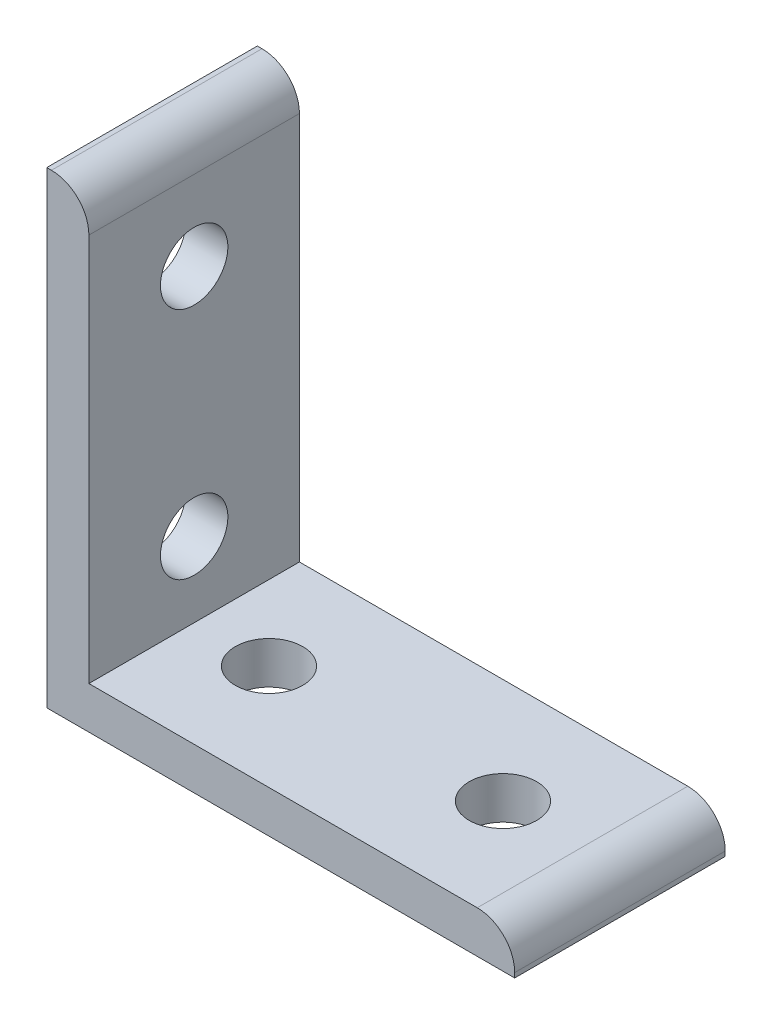
ISO-10303-21;
HEADER;
FILE_DESCRIPTION(('STEP AP214'),'2;1');
FILE_NAME('part.step','',(''),(''),'','','');
FILE_SCHEMA(('AUTOMOTIVE_DESIGN { 1 0 10303 214 1 1 1 1 }'));
ENDSEC;
DATA;
#1=APPLICATION_CONTEXT('core data for automotive mechanical design processes');
#2=APPLICATION_PROTOCOL_DEFINITION('international standard','automotive_design',2000,#1);
#3=PRODUCT_CONTEXT('',#1,'mechanical');
#4=PRODUCT('Part','Part','',(#3));
#5=PRODUCT_RELATED_PRODUCT_CATEGORY('part','',(#4));
#6=PRODUCT_DEFINITION_FORMATION('','',#4);
#7=PRODUCT_DEFINITION_CONTEXT('part definition',#1,'design');
#8=PRODUCT_DEFINITION('design','',#6,#7);
#9=PRODUCT_DEFINITION_SHAPE('','',#8);
#10=(LENGTH_UNIT() NAMED_UNIT(*) SI_UNIT(.MILLI.,.METRE.));
#11=(NAMED_UNIT(*) PLANE_ANGLE_UNIT() SI_UNIT($,.RADIAN.));
#12=(NAMED_UNIT(*) SI_UNIT($,.STERADIAN.) SOLID_ANGLE_UNIT());
#13=UNCERTAINTY_MEASURE_WITH_UNIT(LENGTH_MEASURE(1.E-05),#10,'distance_accuracy_value','');
#14=(GEOMETRIC_REPRESENTATION_CONTEXT(3) GLOBAL_UNCERTAINTY_ASSIGNED_CONTEXT((#13)) GLOBAL_UNIT_ASSIGNED_CONTEXT((#10,
#11,#12)) REPRESENTATION_CONTEXT('',''));
#15=CARTESIAN_POINT('',(0.,0.,0.));
#16=DIRECTION('',(0.,0.,1.));
#17=DIRECTION('',(1.,0.,0.));
#18=AXIS2_PLACEMENT_3D('',#15,#16,#17);
#19=CARTESIAN_POINT('',(0.,50.,22.5));
#20=DIRECTION('',(0.,-1.,0.));
#21=DIRECTION('',(0.,0.,-1.));
#22=AXIS2_PLACEMENT_3D('',#19,#20,#21);
#23=PLANE('',#22);
#24=DIRECTION('',(-1.,0.,0.));
#25=VECTOR('',#24,1.);
#26=CARTESIAN_POINT('',(0.,50.,22.5));
#27=LINE('',#26,#25);
#28=CARTESIAN_POINT('',(0.500000000000001,50.,22.5));
#29=VERTEX_POINT('',#28);
#30=CARTESIAN_POINT('',(0.,50.,22.5));
#31=VERTEX_POINT('',#30);
#32=EDGE_CURVE('E95',#29,#31,#27,.T.);
#33=ORIENTED_EDGE('',*,*,#32,.F.);
#34=DIRECTION('',(0.,0.,-1.));
#35=VECTOR('',#34,1.);
#36=CARTESIAN_POINT('',(0.500000000000001,50.,22.5));
#37=LINE('',#36,#35);
#38=CARTESIAN_POINT('',(0.500000000000001,50.,0.));
#39=VERTEX_POINT('',#38);
#40=EDGE_CURVE('E41',#29,#39,#37,.T.);
#41=ORIENTED_EDGE('',*,*,#40,.T.);
#42=DIRECTION('',(-1.,0.,0.));
#43=VECTOR('',#42,1.);
#44=CARTESIAN_POINT('',(0.,50.,0.));
#45=LINE('',#44,#43);
#46=CARTESIAN_POINT('',(0.,50.,0.));
#47=VERTEX_POINT('',#46);
#48=EDGE_CURVE('E117',#39,#47,#45,.T.);
#49=ORIENTED_EDGE('',*,*,#48,.T.);
#50=DIRECTION('',(0.,0.,-1.));
#51=VECTOR('',#50,1.);
#52=CARTESIAN_POINT('',(0.,50.,22.5));
#53=LINE('',#52,#51);
#54=EDGE_CURVE('E110',#31,#47,#53,.T.);
#55=ORIENTED_EDGE('',*,*,#54,.F.);
#56=EDGE_LOOP('',(#33,#41,#49,#55));
#57=FACE_BOUND('',#56,.T.);
#58=ADVANCED_FACE('F33',(#57),#23,.F.);
#59=CARTESIAN_POINT('',(0.,50.,22.5));
#60=DIRECTION('',(1.,0.,0.));
#61=DIRECTION('',(0.,0.,-1.));
#62=AXIS2_PLACEMENT_3D('',#59,#60,#61);
#63=PLANE('',#62);
#64=CARTESIAN_POINT('',(0.,37.5,11.25));
#65=DIRECTION('',(-1.,0.,0.));
#66=DIRECTION('',(0.,0.,1.));
#67=AXIS2_PLACEMENT_3D('',#64,#65,#66);
#68=CIRCLE('',#67,3.6);
#69=CARTESIAN_POINT('',(0.,37.5,14.85));
#70=VERTEX_POINT('',#69);
#71=EDGE_CURVE('E132',#70,#70,#68,.T.);
#72=ORIENTED_EDGE('',*,*,#71,.F.);
#73=EDGE_LOOP('',(#72));
#74=FACE_BOUND('',#73,.T.);
#75=CARTESIAN_POINT('',(0.,12.5,11.25));
#76=DIRECTION('',(-1.,0.,0.));
#77=DIRECTION('',(0.,0.,1.));
#78=AXIS2_PLACEMENT_3D('',#75,#76,#77);
#79=CIRCLE('',#78,3.6);
#80=CARTESIAN_POINT('',(0.,12.5,14.85));
#81=VERTEX_POINT('',#80);
#82=EDGE_CURVE('E141',#81,#81,#79,.T.);
#83=ORIENTED_EDGE('',*,*,#82,.F.);
#84=EDGE_LOOP('',(#83));
#85=FACE_BOUND('',#84,.T.);
#86=DIRECTION('',(0.,-1.,0.));
#87=VECTOR('',#86,1.);
#88=CARTESIAN_POINT('',(0.,50.,0.));
#89=LINE('',#88,#87);
#90=CARTESIAN_POINT('',(0.,0.,0.));
#91=VERTEX_POINT('',#90);
#92=EDGE_CURVE('E156',#47,#91,#89,.T.);
#93=ORIENTED_EDGE('',*,*,#92,.T.);
#94=DIRECTION('',(0.,0.,-1.));
#95=VECTOR('',#94,1.);
#96=CARTESIAN_POINT('',(0.,0.,22.5));
#97=LINE('',#96,#95);
#98=CARTESIAN_POINT('',(0.,0.,22.5));
#99=VERTEX_POINT('',#98);
#100=EDGE_CURVE('E112',#99,#91,#97,.T.);
#101=ORIENTED_EDGE('',*,*,#100,.F.);
#102=DIRECTION('',(0.,-1.,0.));
#103=VECTOR('',#102,1.);
#104=CARTESIAN_POINT('',(0.,50.,22.5));
#105=LINE('',#104,#103);
#106=EDGE_CURVE('E99',#31,#99,#105,.T.);
#107=ORIENTED_EDGE('',*,*,#106,.F.);
#108=ORIENTED_EDGE('',*,*,#54,.T.);
#109=EDGE_LOOP('',(#93,#101,#107,#108));
#110=FACE_BOUND('',#109,.T.);
#111=ADVANCED_FACE('F109',(#74,#85,#110),#63,.F.);
#112=CARTESIAN_POINT('',(0.,0.,22.5));
#113=DIRECTION('',(0.,1.,0.));
#114=DIRECTION('',(0.,0.,1.));
#115=AXIS2_PLACEMENT_3D('',#112,#113,#114);
#116=PLANE('',#115);
#117=CARTESIAN_POINT('',(37.5,0.,11.25));
#118=DIRECTION('',(0.,-1.,0.));
#119=DIRECTION('',(0.,0.,-1.));
#120=AXIS2_PLACEMENT_3D('',#117,#118,#119);
#121=CIRCLE('',#120,3.6);
#122=CARTESIAN_POINT('',(37.5,0.,7.65));
#123=VERTEX_POINT('',#122);
#124=EDGE_CURVE('E139',#123,#123,#121,.T.);
#125=ORIENTED_EDGE('',*,*,#124,.F.);
#126=EDGE_LOOP('',(#125));
#127=FACE_BOUND('',#126,.T.);
#128=CARTESIAN_POINT('',(12.5,0.,11.25));
#129=DIRECTION('',(0.,-1.,0.));
#130=DIRECTION('',(0.,0.,-1.));
#131=AXIS2_PLACEMENT_3D('',#128,#129,#130);
#132=CIRCLE('',#131,3.6);
#133=CARTESIAN_POINT('',(12.5,0.,7.65));
#134=VERTEX_POINT('',#133);
#135=EDGE_CURVE('E198',#134,#134,#132,.T.);
#136=ORIENTED_EDGE('',*,*,#135,.F.);
#137=EDGE_LOOP('',(#136));
#138=FACE_BOUND('',#137,.T.);
#139=DIRECTION('',(1.,0.,0.));
#140=VECTOR('',#139,1.);
#141=CARTESIAN_POINT('',(0.,0.,0.));
#142=LINE('',#141,#140);
#143=CARTESIAN_POINT('',(50.,0.,0.));
#144=VERTEX_POINT('',#143);
#145=EDGE_CURVE('E158',#91,#144,#142,.T.);
#146=ORIENTED_EDGE('',*,*,#145,.T.);
#147=DIRECTION('',(0.,0.,-1.));
#148=VECTOR('',#147,1.);
#149=CARTESIAN_POINT('',(50.,0.,22.5));
#150=LINE('',#149,#148);
#151=CARTESIAN_POINT('',(50.,0.,22.5));
#152=VERTEX_POINT('',#151);
#153=EDGE_CURVE('E124',#152,#144,#150,.T.);
#154=ORIENTED_EDGE('',*,*,#153,.F.);
#155=DIRECTION('',(1.,0.,0.));
#156=VECTOR('',#155,1.);
#157=CARTESIAN_POINT('',(0.,0.,22.5));
#158=LINE('',#157,#156);
#159=EDGE_CURVE('E114',#99,#152,#158,.T.);
#160=ORIENTED_EDGE('',*,*,#159,.F.);
#161=ORIENTED_EDGE('',*,*,#100,.T.);
#162=EDGE_LOOP('',(#146,#154,#160,#161));
#163=FACE_BOUND('',#162,.T.);
#164=ADVANCED_FACE('F207',(#127,#138,#163),#116,.F.);
#165=CARTESIAN_POINT('',(50.,4.5,22.5));
#166=DIRECTION('',(-1.,0.,0.));
#167=DIRECTION('',(0.,0.,1.));
#168=AXIS2_PLACEMENT_3D('',#165,#166,#167);
#169=PLANE('',#168);
#170=DIRECTION('',(0.,1.,0.));
#171=VECTOR('',#170,1.);
#172=CARTESIAN_POINT('',(50.,4.5,0.));
#173=LINE('',#172,#171);
#174=CARTESIAN_POINT('',(50.,0.500000000000001,0.));
#175=VERTEX_POINT('',#174);
#176=EDGE_CURVE('E165',#144,#175,#173,.T.);
#177=ORIENTED_EDGE('',*,*,#176,.T.);
#178=DIRECTION('',(0.,0.,-1.));
#179=VECTOR('',#178,1.);
#180=CARTESIAN_POINT('',(50.,0.500000000000001,22.5));
#181=LINE('',#180,#179);
#182=CARTESIAN_POINT('',(50.,0.500000000000001,22.5));
#183=VERTEX_POINT('',#182);
#184=EDGE_CURVE('E146',#175,#183,#181,.F.);
#185=ORIENTED_EDGE('',*,*,#184,.T.);
#186=DIRECTION('',(0.,1.,0.));
#187=VECTOR('',#186,1.);
#188=CARTESIAN_POINT('',(50.,4.5,22.5));
#189=LINE('',#188,#187);
#190=EDGE_CURVE('E180',#152,#183,#189,.T.);
#191=ORIENTED_EDGE('',*,*,#190,.F.);
#192=ORIENTED_EDGE('',*,*,#153,.T.);
#193=EDGE_LOOP('',(#177,#185,#191,#192));
#194=FACE_BOUND('',#193,.T.);
#195=ADVANCED_FACE('F178',(#194),#169,.F.);
#196=CARTESIAN_POINT('',(4.5,4.5,22.5));
#197=DIRECTION('',(0.,-1.,0.));
#198=DIRECTION('',(0.,0.,-1.));
#199=AXIS2_PLACEMENT_3D('',#196,#197,#198);
#200=PLANE('',#199);
#201=CARTESIAN_POINT('',(37.5,4.5,11.25));
#202=DIRECTION('',(0.,-1.,0.));
#203=DIRECTION('',(0.,0.,-1.));
#204=AXIS2_PLACEMENT_3D('',#201,#202,#203);
#205=CIRCLE('',#204,3.6);
#206=CARTESIAN_POINT('',(37.5,4.5,7.65));
#207=VERTEX_POINT('',#206);
#208=EDGE_CURVE('E138',#207,#207,#205,.T.);
#209=ORIENTED_EDGE('',*,*,#208,.T.);
#210=EDGE_LOOP('',(#209));
#211=FACE_BOUND('',#210,.T.);
#212=CARTESIAN_POINT('',(12.5,4.5,11.25));
#213=DIRECTION('',(0.,-1.,0.));
#214=DIRECTION('',(0.,0.,-1.));
#215=AXIS2_PLACEMENT_3D('',#212,#213,#214);
#216=CIRCLE('',#215,3.6);
#217=CARTESIAN_POINT('',(12.5,4.5,7.65));
#218=VERTEX_POINT('',#217);
#219=EDGE_CURVE('E135',#218,#218,#216,.T.);
#220=ORIENTED_EDGE('',*,*,#219,.T.);
#221=EDGE_LOOP('',(#220));
#222=FACE_BOUND('',#221,.T.);
#223=DIRECTION('',(-1.,0.,0.));
#224=VECTOR('',#223,1.);
#225=CARTESIAN_POINT('',(4.5,4.5,22.5));
#226=LINE('',#225,#224);
#227=CARTESIAN_POINT('',(46.,4.5,22.5));
#228=VERTEX_POINT('',#227);
#229=CARTESIAN_POINT('',(4.5,4.5,22.5));
#230=VERTEX_POINT('',#229);
#231=EDGE_CURVE('E190',#228,#230,#226,.T.);
#232=ORIENTED_EDGE('',*,*,#231,.F.);
#233=DIRECTION('',(0.,0.,-1.));
#234=VECTOR('',#233,1.);
#235=CARTESIAN_POINT('',(46.,4.5,22.5));
#236=LINE('',#235,#234);
#237=CARTESIAN_POINT('',(46.,4.5,0.));
#238=VERTEX_POINT('',#237);
#239=EDGE_CURVE('E119',#228,#238,#236,.T.);
#240=ORIENTED_EDGE('',*,*,#239,.T.);
#241=DIRECTION('',(-1.,0.,0.));
#242=VECTOR('',#241,1.);
#243=CARTESIAN_POINT('',(4.5,4.5,0.));
#244=LINE('',#243,#242);
#245=CARTESIAN_POINT('',(4.5,4.5,0.));
#246=VERTEX_POINT('',#245);
#247=EDGE_CURVE('E168',#238,#246,#244,.T.);
#248=ORIENTED_EDGE('',*,*,#247,.T.);
#249=DIRECTION('',(0.,0.,-1.));
#250=VECTOR('',#249,1.);
#251=CARTESIAN_POINT('',(4.5,4.5,22.5));
#252=LINE('',#251,#250);
#253=EDGE_CURVE('E171',#230,#246,#252,.T.);
#254=ORIENTED_EDGE('',*,*,#253,.F.);
#255=EDGE_LOOP('',(#232,#240,#248,#254));
#256=FACE_BOUND('',#255,.T.);
#257=ADVANCED_FACE('F188',(#211,#222,#256),#200,.F.);
#258=CARTESIAN_POINT('',(4.5,50.,22.5));
#259=DIRECTION('',(-1.,0.,0.));
#260=DIRECTION('',(0.,0.,1.));
#261=AXIS2_PLACEMENT_3D('',#258,#259,#260);
#262=PLANE('',#261);
#263=CARTESIAN_POINT('',(4.5,37.5,11.25));
#264=DIRECTION('',(-1.,0.,0.));
#265=DIRECTION('',(0.,0.,1.));
#266=AXIS2_PLACEMENT_3D('',#263,#264,#265);
#267=CIRCLE('',#266,3.6);
#268=CARTESIAN_POINT('',(4.5,37.5,14.85));
#269=VERTEX_POINT('',#268);
#270=EDGE_CURVE('E131',#269,#269,#267,.T.);
#271=ORIENTED_EDGE('',*,*,#270,.T.);
#272=EDGE_LOOP('',(#271));
#273=FACE_BOUND('',#272,.T.);
#274=CARTESIAN_POINT('',(4.5,12.5,11.25));
#275=DIRECTION('',(-1.,0.,0.));
#276=DIRECTION('',(0.,0.,1.));
#277=AXIS2_PLACEMENT_3D('',#274,#275,#276);
#278=CIRCLE('',#277,3.6);
#279=CARTESIAN_POINT('',(4.5,12.5,14.85));
#280=VERTEX_POINT('',#279);
#281=EDGE_CURVE('E128',#280,#280,#278,.T.);
#282=ORIENTED_EDGE('',*,*,#281,.T.);
#283=EDGE_LOOP('',(#282));
#284=FACE_BOUND('',#283,.T.);
#285=DIRECTION('',(0.,1.,0.));
#286=VECTOR('',#285,1.);
#287=CARTESIAN_POINT('',(4.5,50.,0.));
#288=LINE('',#287,#286);
#289=CARTESIAN_POINT('',(4.5,46.,0.));
#290=VERTEX_POINT('',#289);
#291=EDGE_CURVE('E105',#246,#290,#288,.T.);
#292=ORIENTED_EDGE('',*,*,#291,.T.);
#293=DIRECTION('',(0.,0.,-1.));
#294=VECTOR('',#293,1.);
#295=CARTESIAN_POINT('',(4.5,46.,22.5));
#296=LINE('',#295,#294);
#297=CARTESIAN_POINT('',(4.5,46.,22.5));
#298=VERTEX_POINT('',#297);
#299=EDGE_CURVE('E11',#290,#298,#296,.F.);
#300=ORIENTED_EDGE('',*,*,#299,.T.);
#301=DIRECTION('',(0.,1.,0.));
#302=VECTOR('',#301,1.);
#303=CARTESIAN_POINT('',(4.5,50.,22.5));
#304=LINE('',#303,#302);
#305=EDGE_CURVE('E161',#230,#298,#304,.T.);
#306=ORIENTED_EDGE('',*,*,#305,.F.);
#307=ORIENTED_EDGE('',*,*,#253,.T.);
#308=EDGE_LOOP('',(#292,#300,#306,#307));
#309=FACE_BOUND('',#308,.T.);
#310=ADVANCED_FACE('F221',(#273,#284,#309),#262,.F.);
#311=CARTESIAN_POINT('',(0.,0.,22.5));
#312=DIRECTION('',(0.,0.,-1.));
#313=DIRECTION('',(-1.,0.,0.));
#314=AXIS2_PLACEMENT_3D('',#311,#312,#313);
#315=PLANE('',#314);
#316=ORIENTED_EDGE('',*,*,#190,.T.);
#317=CARTESIAN_POINT('',(46.,0.500000000000001,22.5));
#318=DIRECTION('',(0.,0.,-1.));
#319=DIRECTION('',(-1.,0.,0.));
#320=AXIS2_PLACEMENT_3D('',#317,#318,#319);
#321=CIRCLE('',#320,4.);
#322=EDGE_CURVE('E149',#183,#228,#321,.F.);
#323=ORIENTED_EDGE('',*,*,#322,.T.);
#324=ORIENTED_EDGE('',*,*,#231,.T.);
#325=ORIENTED_EDGE('',*,*,#305,.T.);
#326=CARTESIAN_POINT('',(0.500000000000001,46.,22.5));
#327=DIRECTION('',(0.,0.,-1.));
#328=DIRECTION('',(-1.,0.,0.));
#329=AXIS2_PLACEMENT_3D('',#326,#327,#328);
#330=CIRCLE('',#329,4.);
#331=EDGE_CURVE('E53',#298,#29,#330,.F.);
#332=ORIENTED_EDGE('',*,*,#331,.T.);
#333=ORIENTED_EDGE('',*,*,#32,.T.);
#334=ORIENTED_EDGE('',*,*,#106,.T.);
#335=ORIENTED_EDGE('',*,*,#159,.T.);
#336=EDGE_LOOP('',(#316,#323,#324,#325,#332,#333,#334,#335));
#337=FACE_BOUND('',#336,.T.);
#338=ADVANCED_FACE('F98',(#337),#315,.F.);
#339=CARTESIAN_POINT('',(0.,0.,0.));
#340=DIRECTION('',(0.,0.,-1.));
#341=DIRECTION('',(-1.,0.,0.));
#342=AXIS2_PLACEMENT_3D('',#339,#340,#341);
#343=PLANE('',#342);
#344=ORIENTED_EDGE('',*,*,#247,.F.);
#345=CARTESIAN_POINT('',(46.,0.500000000000001,0.));
#346=DIRECTION('',(0.,0.,-1.));
#347=DIRECTION('',(-1.,0.,0.));
#348=AXIS2_PLACEMENT_3D('',#345,#346,#347);
#349=CIRCLE('',#348,4.);
#350=EDGE_CURVE('E144',#238,#175,#349,.T.);
#351=ORIENTED_EDGE('',*,*,#350,.T.);
#352=ORIENTED_EDGE('',*,*,#176,.F.);
#353=ORIENTED_EDGE('',*,*,#145,.F.);
#354=ORIENTED_EDGE('',*,*,#92,.F.);
#355=ORIENTED_EDGE('',*,*,#48,.F.);
#356=CARTESIAN_POINT('',(0.500000000000001,46.,0.));
#357=DIRECTION('',(0.,0.,-1.));
#358=DIRECTION('',(-1.,0.,0.));
#359=AXIS2_PLACEMENT_3D('',#356,#357,#358);
#360=CIRCLE('',#359,4.);
#361=EDGE_CURVE('E122',#39,#290,#360,.T.);
#362=ORIENTED_EDGE('',*,*,#361,.T.);
#363=ORIENTED_EDGE('',*,*,#291,.F.);
#364=EDGE_LOOP('',(#344,#351,#352,#353,#354,#355,#362,#363));
#365=FACE_BOUND('',#364,.T.);
#366=ADVANCED_FACE('F153',(#365),#343,.T.);
#367=CARTESIAN_POINT('',(50.,12.5,11.25));
#368=DIRECTION('',(-1.,0.,0.));
#369=DIRECTION('',(0.,0.,1.));
#370=AXIS2_PLACEMENT_3D('',#367,#368,#369);
#371=CYLINDRICAL_SURFACE('',#370,3.6);
#372=ORIENTED_EDGE('',*,*,#82,.T.);
#373=EDGE_LOOP('',(#372));
#374=FACE_BOUND('',#373,.T.);
#375=ORIENTED_EDGE('',*,*,#281,.F.);
#376=EDGE_LOOP('',(#375));
#377=FACE_BOUND('',#376,.T.);
#378=ADVANCED_FACE('F249',(#374,#377),#371,.F.);
#379=CARTESIAN_POINT('',(50.,37.5,11.25));
#380=DIRECTION('',(-1.,0.,0.));
#381=DIRECTION('',(0.,0.,1.));
#382=AXIS2_PLACEMENT_3D('',#379,#380,#381);
#383=CYLINDRICAL_SURFACE('',#382,3.6);
#384=ORIENTED_EDGE('',*,*,#71,.T.);
#385=EDGE_LOOP('',(#384));
#386=FACE_BOUND('',#385,.T.);
#387=ORIENTED_EDGE('',*,*,#270,.F.);
#388=EDGE_LOOP('',(#387));
#389=FACE_BOUND('',#388,.T.);
#390=ADVANCED_FACE('F216',(#386,#389),#383,.F.);
#391=CARTESIAN_POINT('',(12.5,50.,11.25));
#392=DIRECTION('',(0.,-1.,0.));
#393=DIRECTION('',(0.,0.,-1.));
#394=AXIS2_PLACEMENT_3D('',#391,#392,#393);
#395=CYLINDRICAL_SURFACE('',#394,3.6);
#396=ORIENTED_EDGE('',*,*,#135,.T.);
#397=EDGE_LOOP('',(#396));
#398=FACE_BOUND('',#397,.T.);
#399=ORIENTED_EDGE('',*,*,#219,.F.);
#400=EDGE_LOOP('',(#399));
#401=FACE_BOUND('',#400,.T.);
#402=ADVANCED_FACE('F213',(#398,#401),#395,.F.);
#403=CARTESIAN_POINT('',(37.5,50.,11.25));
#404=DIRECTION('',(0.,-1.,0.));
#405=DIRECTION('',(0.,0.,-1.));
#406=AXIS2_PLACEMENT_3D('',#403,#404,#405);
#407=CYLINDRICAL_SURFACE('',#406,3.6);
#408=ORIENTED_EDGE('',*,*,#124,.T.);
#409=EDGE_LOOP('',(#408));
#410=FACE_BOUND('',#409,.T.);
#411=ORIENTED_EDGE('',*,*,#208,.F.);
#412=EDGE_LOOP('',(#411));
#413=FACE_BOUND('',#412,.T.);
#414=ADVANCED_FACE('F204',(#410,#413),#407,.F.);
#415=CARTESIAN_POINT('',(46.,0.500000000000001,22.5));
#416=DIRECTION('',(0.,0.,-1.));
#417=DIRECTION('',(-1.,0.,0.));
#418=AXIS2_PLACEMENT_3D('',#415,#416,#417);
#419=CYLINDRICAL_SURFACE('',#418,4.);
#420=ORIENTED_EDGE('',*,*,#322,.F.);
#421=ORIENTED_EDGE('',*,*,#184,.F.);
#422=ORIENTED_EDGE('',*,*,#350,.F.);
#423=ORIENTED_EDGE('',*,*,#239,.F.);
#424=EDGE_LOOP('',(#420,#421,#422,#423));
#425=FACE_BOUND('',#424,.T.);
#426=ADVANCED_FACE('F185',(#425),#419,.T.);
#427=CARTESIAN_POINT('',(0.500000000000001,46.,22.5));
#428=DIRECTION('',(0.,0.,-1.));
#429=DIRECTION('',(-1.,0.,0.));
#430=AXIS2_PLACEMENT_3D('',#427,#428,#429);
#431=CYLINDRICAL_SURFACE('',#430,4.);
#432=ORIENTED_EDGE('',*,*,#331,.F.);
#433=ORIENTED_EDGE('',*,*,#299,.F.);
#434=ORIENTED_EDGE('',*,*,#361,.F.);
#435=ORIENTED_EDGE('',*,*,#40,.F.);
#436=EDGE_LOOP('',(#432,#433,#434,#435));
#437=FACE_BOUND('',#436,.T.);
#438=ADVANCED_FACE('F35',(#437),#431,.T.);
#439=CLOSED_SHELL('',(#58,#111,#164,#195,#257,#310,#338,#366,#378,#390,#402,#414,#426,#438));
#440=MANIFOLD_SOLID_BREP('B2',#439);
#441=ADVANCED_BREP_SHAPE_REPRESENTATION('',(#18,#440),#14);
#442=SHAPE_DEFINITION_REPRESENTATION(#9,#441);
ENDSEC;
END-ISO-10303-21;
